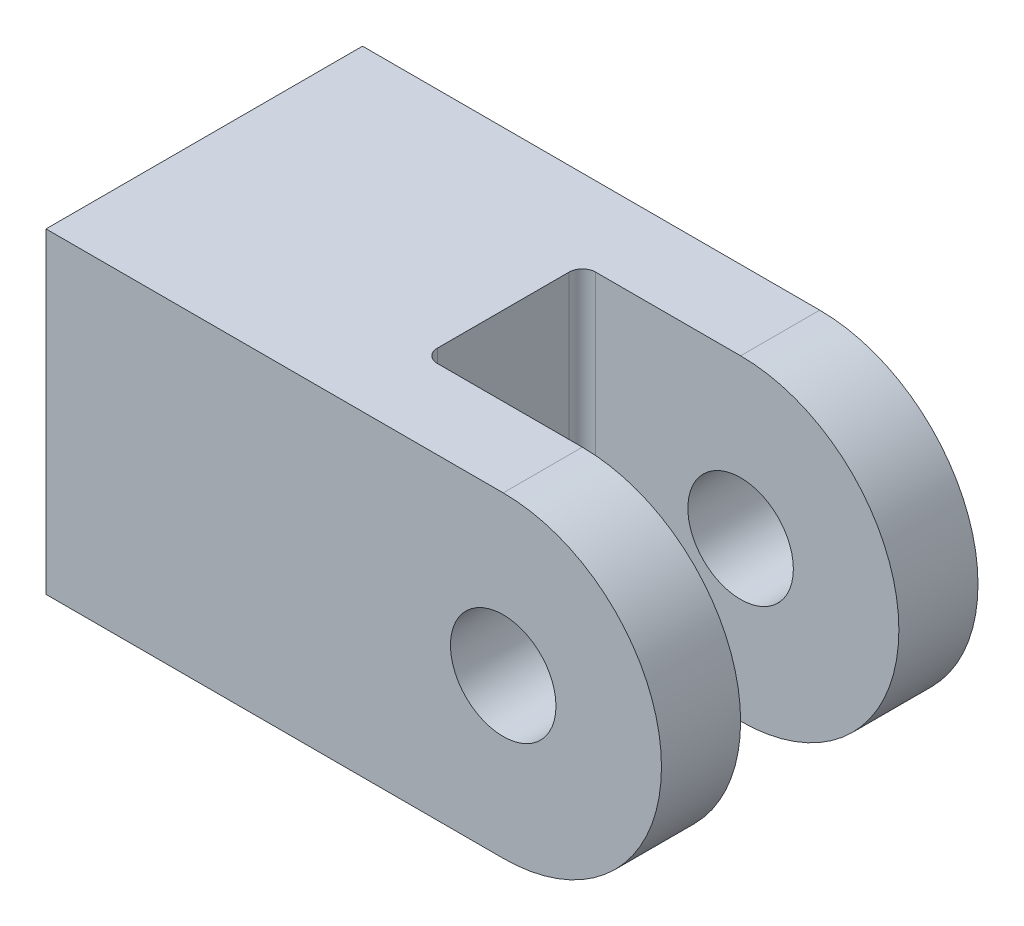
ISO-10303-21;
HEADER;
FILE_DESCRIPTION(('STEP AP214'),'2;1');
FILE_NAME('part.step','',(''),(''),'','','');
FILE_SCHEMA(('AUTOMOTIVE_DESIGN { 1 0 10303 214 1 1 1 1 }'));
ENDSEC;
DATA;
#1=APPLICATION_CONTEXT('core data for automotive mechanical design processes');
#2=APPLICATION_PROTOCOL_DEFINITION('international standard','automotive_design',2000,#1);
#3=PRODUCT_CONTEXT('',#1,'mechanical');
#4=PRODUCT('Part','Part','',(#3));
#5=PRODUCT_RELATED_PRODUCT_CATEGORY('part','',(#4));
#6=PRODUCT_DEFINITION_FORMATION('','',#4);
#7=PRODUCT_DEFINITION_CONTEXT('part definition',#1,'design');
#8=PRODUCT_DEFINITION('design','',#6,#7);
#9=PRODUCT_DEFINITION_SHAPE('','',#8);
#10=(LENGTH_UNIT() NAMED_UNIT(*) SI_UNIT(.MILLI.,.METRE.));
#11=(NAMED_UNIT(*) PLANE_ANGLE_UNIT() SI_UNIT($,.RADIAN.));
#12=(NAMED_UNIT(*) SI_UNIT($,.STERADIAN.) SOLID_ANGLE_UNIT());
#13=UNCERTAINTY_MEASURE_WITH_UNIT(LENGTH_MEASURE(1.E-05),#10,'distance_accuracy_value','');
#14=(GEOMETRIC_REPRESENTATION_CONTEXT(3) GLOBAL_UNCERTAINTY_ASSIGNED_CONTEXT((#13)) GLOBAL_UNIT_ASSIGNED_CONTEXT((#10,
#11,#12)) REPRESENTATION_CONTEXT('',''));
#15=CARTESIAN_POINT('',(0.,0.,0.));
#16=DIRECTION('',(0.,0.,1.));
#17=DIRECTION('',(1.,0.,0.));
#18=AXIS2_PLACEMENT_3D('',#15,#16,#17);
#19=CARTESIAN_POINT('',(52.,18.,18.));
#20=DIRECTION('',(0.,0.,-1.));
#21=DIRECTION('',(-1.,0.,0.));
#22=AXIS2_PLACEMENT_3D('',#19,#20,#21);
#23=CYLINDRICAL_SURFACE('',#22,18.);
#24=CARTESIAN_POINT('',(52.,18.,9.));
#25=DIRECTION('',(0.,0.,-1.));
#26=DIRECTION('',(-1.,0.,0.));
#27=AXIS2_PLACEMENT_3D('',#24,#25,#26);
#28=CIRCLE('',#27,18.);
#29=CARTESIAN_POINT('',(52.,36.,9.));
#30=VERTEX_POINT('',#29);
#31=CARTESIAN_POINT('',(52.,0.,9.));
#32=VERTEX_POINT('',#31);
#33=EDGE_CURVE('E156',#30,#32,#28,.T.);
#34=ORIENTED_EDGE('',*,*,#33,.F.);
#35=DIRECTION('',(0.,0.,-1.));
#36=VECTOR('',#35,1.);
#37=CARTESIAN_POINT('',(52.,36.,18.));
#38=LINE('',#37,#36);
#39=CARTESIAN_POINT('',(52.,36.,18.));
#40=VERTEX_POINT('',#39);
#41=EDGE_CURVE('E148',#40,#30,#38,.T.);
#42=ORIENTED_EDGE('',*,*,#41,.F.);
#43=CARTESIAN_POINT('',(52.,18.,18.));
#44=DIRECTION('',(0.,0.,1.));
#45=DIRECTION('',(1.,0.,0.));
#46=AXIS2_PLACEMENT_3D('',#43,#44,#45);
#47=CIRCLE('',#46,18.);
#48=CARTESIAN_POINT('',(52.,0.,18.));
#49=VERTEX_POINT('',#48);
#50=EDGE_CURVE('E211',#49,#40,#47,.T.);
#51=ORIENTED_EDGE('',*,*,#50,.F.);
#52=DIRECTION('',(0.,0.,-1.));
#53=VECTOR('',#52,1.);
#54=CARTESIAN_POINT('',(52.,0.,18.));
#55=LINE('',#54,#53);
#56=EDGE_CURVE('E136',#49,#32,#55,.T.);
#57=ORIENTED_EDGE('',*,*,#56,.T.);
#58=EDGE_LOOP('',(#34,#42,#51,#57));
#59=FACE_BOUND('',#58,.T.);
#60=ADVANCED_FACE('F34',(#59),#23,.T.);
#61=CARTESIAN_POINT('',(52.,18.,-9.));
#62=DIRECTION('',(0.,0.,1.));
#63=DIRECTION('',(1.,0.,0.));
#64=AXIS2_PLACEMENT_3D('',#61,#62,#63);
#65=CIRCLE('',#64,18.);
#66=CARTESIAN_POINT('',(52.,0.,-9.));
#67=VERTEX_POINT('',#66);
#68=CARTESIAN_POINT('',(52.,36.,-9.));
#69=VERTEX_POINT('',#68);
#70=EDGE_CURVE('E114',#67,#69,#65,.T.);
#71=ORIENTED_EDGE('',*,*,#70,.F.);
#72=CARTESIAN_POINT('',(52.,0.,-18.));
#73=VERTEX_POINT('',#72);
#74=EDGE_CURVE('E126',#67,#73,#55,.T.);
#75=ORIENTED_EDGE('',*,*,#74,.T.);
#76=CARTESIAN_POINT('',(52.,18.,-18.));
#77=DIRECTION('',(0.,0.,1.));
#78=DIRECTION('',(1.,0.,0.));
#79=AXIS2_PLACEMENT_3D('',#76,#77,#78);
#80=CIRCLE('',#79,18.);
#81=CARTESIAN_POINT('',(52.,36.,-18.));
#82=VERTEX_POINT('',#81);
#83=EDGE_CURVE('E222',#73,#82,#80,.T.);
#84=ORIENTED_EDGE('',*,*,#83,.T.);
#85=EDGE_CURVE('E128',#69,#82,#38,.T.);
#86=ORIENTED_EDGE('',*,*,#85,.F.);
#87=EDGE_LOOP('',(#71,#75,#84,#86));
#88=FACE_BOUND('',#87,.T.);
#89=ADVANCED_FACE('F124',(#88),#23,.T.);
#90=CARTESIAN_POINT('',(0.,36.,18.));
#91=DIRECTION('',(0.,1.,0.));
#92=DIRECTION('',(0.,0.,1.));
#93=AXIS2_PLACEMENT_3D('',#90,#91,#92);
#94=PLANE('',#93);
#95=ORIENTED_EDGE('',*,*,#41,.T.);
#96=DIRECTION('',(1.,0.,0.));
#97=VECTOR('',#96,1.);
#98=CARTESIAN_POINT('',(34.,36.,9.));
#99=LINE('',#98,#97);
#100=CARTESIAN_POINT('',(35.5,36.,9.));
#101=VERTEX_POINT('',#100);
#102=EDGE_CURVE('E203',#101,#30,#99,.T.);
#103=ORIENTED_EDGE('',*,*,#102,.F.);
#104=CARTESIAN_POINT('',(35.5,36.,7.5));
#105=DIRECTION('',(0.,1.,0.));
#106=DIRECTION('',(0.,0.,1.));
#107=AXIS2_PLACEMENT_3D('',#104,#105,#106);
#108=CIRCLE('',#107,1.5);
#109=CARTESIAN_POINT('',(34.,36.,7.5));
#110=VERTEX_POINT('',#109);
#111=EDGE_CURVE('E169',#101,#110,#108,.F.);
#112=ORIENTED_EDGE('',*,*,#111,.T.);
#113=DIRECTION('',(0.,0.,1.));
#114=VECTOR('',#113,1.);
#115=CARTESIAN_POINT('',(34.,36.,9.));
#116=LINE('',#115,#114);
#117=CARTESIAN_POINT('',(34.,36.,-7.5));
#118=VERTEX_POINT('',#117);
#119=EDGE_CURVE('E119',#118,#110,#116,.T.);
#120=ORIENTED_EDGE('',*,*,#119,.F.);
#121=CARTESIAN_POINT('',(35.5,36.,-7.5));
#122=DIRECTION('',(0.,1.,0.));
#123=DIRECTION('',(0.,0.,1.));
#124=AXIS2_PLACEMENT_3D('',#121,#122,#123);
#125=CIRCLE('',#124,1.5);
#126=CARTESIAN_POINT('',(35.5,36.,-9.));
#127=VERTEX_POINT('',#126);
#128=EDGE_CURVE('E166',#118,#127,#125,.F.);
#129=ORIENTED_EDGE('',*,*,#128,.T.);
#130=DIRECTION('',(-1.,0.,0.));
#131=VECTOR('',#130,1.);
#132=CARTESIAN_POINT('',(34.,36.,-9.));
#133=LINE('',#132,#131);
#134=EDGE_CURVE('E153',#69,#127,#133,.T.);
#135=ORIENTED_EDGE('',*,*,#134,.F.);
#136=ORIENTED_EDGE('',*,*,#85,.T.);
#137=DIRECTION('',(1.,0.,0.));
#138=VECTOR('',#137,1.);
#139=CARTESIAN_POINT('',(0.,36.,-18.));
#140=LINE('',#139,#138);
#141=CARTESIAN_POINT('',(0.,36.,-18.));
#142=VERTEX_POINT('',#141);
#143=EDGE_CURVE('E219',#142,#82,#140,.T.);
#144=ORIENTED_EDGE('',*,*,#143,.F.);
#145=DIRECTION('',(0.,0.,-1.));
#146=VECTOR('',#145,1.);
#147=CARTESIAN_POINT('',(0.,36.,18.));
#148=LINE('',#147,#146);
#149=CARTESIAN_POINT('',(0.,36.,18.));
#150=VERTEX_POINT('',#149);
#151=EDGE_CURVE('E146',#150,#142,#148,.T.);
#152=ORIENTED_EDGE('',*,*,#151,.F.);
#153=DIRECTION('',(1.,0.,0.));
#154=VECTOR('',#153,1.);
#155=CARTESIAN_POINT('',(0.,36.,18.));
#156=LINE('',#155,#154);
#157=EDGE_CURVE('E206',#150,#40,#156,.T.);
#158=ORIENTED_EDGE('',*,*,#157,.T.);
#159=EDGE_LOOP('',(#95,#103,#112,#120,#129,#135,#136,#144,#152,#158));
#160=FACE_BOUND('',#159,.T.);
#161=ADVANCED_FACE('F193',(#160),#94,.T.);
#162=CARTESIAN_POINT('',(0.,0.,18.));
#163=DIRECTION('',(0.,1.,0.));
#164=DIRECTION('',(0.,0.,1.));
#165=AXIS2_PLACEMENT_3D('',#162,#163,#164);
#166=PLANE('',#165);
#167=DIRECTION('',(0.,0.,1.));
#168=VECTOR('',#167,1.);
#169=CARTESIAN_POINT('',(34.,0.,9.));
#170=LINE('',#169,#168);
#171=CARTESIAN_POINT('',(34.,0.,-7.5));
#172=VERTEX_POINT('',#171);
#173=CARTESIAN_POINT('',(34.,0.,7.5));
#174=VERTEX_POINT('',#173);
#175=EDGE_CURVE('E237',#172,#174,#170,.T.);
#176=ORIENTED_EDGE('',*,*,#175,.T.);
#177=CARTESIAN_POINT('',(35.5,0.,7.5));
#178=DIRECTION('',(0.,1.,0.));
#179=DIRECTION('',(0.,0.,1.));
#180=AXIS2_PLACEMENT_3D('',#177,#178,#179);
#181=CIRCLE('',#180,1.5);
#182=CARTESIAN_POINT('',(35.5,0.,9.));
#183=VERTEX_POINT('',#182);
#184=EDGE_CURVE('E56',#174,#183,#181,.T.);
#185=ORIENTED_EDGE('',*,*,#184,.T.);
#186=DIRECTION('',(1.,0.,0.));
#187=VECTOR('',#186,1.);
#188=CARTESIAN_POINT('',(34.,0.,9.));
#189=LINE('',#188,#187);
#190=EDGE_CURVE('E120',#183,#32,#189,.T.);
#191=ORIENTED_EDGE('',*,*,#190,.T.);
#192=ORIENTED_EDGE('',*,*,#56,.F.);
#193=DIRECTION('',(1.,0.,0.));
#194=VECTOR('',#193,1.);
#195=CARTESIAN_POINT('',(0.,0.,18.));
#196=LINE('',#195,#194);
#197=CARTESIAN_POINT('',(0.,0.,18.));
#198=VERTEX_POINT('',#197);
#199=EDGE_CURVE('E137',#198,#49,#196,.T.);
#200=ORIENTED_EDGE('',*,*,#199,.F.);
#201=DIRECTION('',(0.,0.,-1.));
#202=VECTOR('',#201,1.);
#203=CARTESIAN_POINT('',(0.,0.,18.));
#204=LINE('',#203,#202);
#205=CARTESIAN_POINT('',(0.,0.,-18.));
#206=VERTEX_POINT('',#205);
#207=EDGE_CURVE('E140',#198,#206,#204,.T.);
#208=ORIENTED_EDGE('',*,*,#207,.T.);
#209=DIRECTION('',(1.,0.,0.));
#210=VECTOR('',#209,1.);
#211=CARTESIAN_POINT('',(0.,0.,-18.));
#212=LINE('',#211,#210);
#213=EDGE_CURVE('E134',#206,#73,#212,.T.);
#214=ORIENTED_EDGE('',*,*,#213,.T.);
#215=ORIENTED_EDGE('',*,*,#74,.F.);
#216=DIRECTION('',(-1.,0.,0.));
#217=VECTOR('',#216,1.);
#218=CARTESIAN_POINT('',(34.,0.,-9.));
#219=LINE('',#218,#217);
#220=CARTESIAN_POINT('',(35.5,0.,-9.));
#221=VERTEX_POINT('',#220);
#222=EDGE_CURVE('E110',#67,#221,#219,.T.);
#223=ORIENTED_EDGE('',*,*,#222,.T.);
#224=CARTESIAN_POINT('',(35.5,0.,-7.5));
#225=DIRECTION('',(0.,1.,0.));
#226=DIRECTION('',(0.,0.,1.));
#227=AXIS2_PLACEMENT_3D('',#224,#225,#226);
#228=CIRCLE('',#227,1.5);
#229=EDGE_CURVE('E164',#221,#172,#228,.T.);
#230=ORIENTED_EDGE('',*,*,#229,.T.);
#231=EDGE_LOOP('',(#176,#185,#191,#192,#200,#208,#214,#215,#223,#230));
#232=FACE_BOUND('',#231,.T.);
#233=ADVANCED_FACE('F132',(#232),#166,.F.);
#234=CARTESIAN_POINT('',(52.,18.,-18.));
#235=DIRECTION('',(0.,0.,1.));
#236=DIRECTION('',(1.,0.,0.));
#237=AXIS2_PLACEMENT_3D('',#234,#235,#236);
#238=CYLINDRICAL_SURFACE('',#237,6.);
#239=CARTESIAN_POINT('',(52.,18.,18.));
#240=DIRECTION('',(0.,0.,1.));
#241=DIRECTION('',(1.,0.,0.));
#242=AXIS2_PLACEMENT_3D('',#239,#240,#241);
#243=CIRCLE('',#242,6.);
#244=CARTESIAN_POINT('',(58.,18.,18.));
#245=VERTEX_POINT('',#244);
#246=EDGE_CURVE('E227',#245,#245,#243,.T.);
#247=ORIENTED_EDGE('',*,*,#246,.T.);
#248=EDGE_LOOP('',(#247));
#249=FACE_BOUND('',#248,.T.);
#250=CARTESIAN_POINT('',(52.,18.,9.));
#251=DIRECTION('',(0.,0.,-1.));
#252=DIRECTION('',(-1.,0.,0.));
#253=AXIS2_PLACEMENT_3D('',#250,#251,#252);
#254=CIRCLE('',#253,6.);
#255=CARTESIAN_POINT('',(46.,18.,9.));
#256=VERTEX_POINT('',#255);
#257=EDGE_CURVE('E129',#256,#256,#254,.F.);
#258=ORIENTED_EDGE('',*,*,#257,.F.);
#259=EDGE_LOOP('',(#258));
#260=FACE_BOUND('',#259,.T.);
#261=ADVANCED_FACE('F272',(#249,#260),#238,.F.);
#262=CARTESIAN_POINT('',(52.,18.,-18.));
#263=DIRECTION('',(0.,0.,1.));
#264=DIRECTION('',(1.,0.,0.));
#265=AXIS2_PLACEMENT_3D('',#262,#263,#264);
#266=CIRCLE('',#265,6.);
#267=CARTESIAN_POINT('',(58.,18.,-18.));
#268=VERTEX_POINT('',#267);
#269=EDGE_CURVE('E224',#268,#268,#266,.T.);
#270=ORIENTED_EDGE('',*,*,#269,.F.);
#271=EDGE_LOOP('',(#270));
#272=FACE_BOUND('',#271,.T.);
#273=CARTESIAN_POINT('',(52.,18.,-9.));
#274=DIRECTION('',(0.,0.,1.));
#275=DIRECTION('',(1.,0.,0.));
#276=AXIS2_PLACEMENT_3D('',#273,#274,#275);
#277=CIRCLE('',#276,6.);
#278=CARTESIAN_POINT('',(58.,18.,-9.));
#279=VERTEX_POINT('',#278);
#280=EDGE_CURVE('E130',#279,#279,#277,.F.);
#281=ORIENTED_EDGE('',*,*,#280,.F.);
#282=EDGE_LOOP('',(#281));
#283=FACE_BOUND('',#282,.T.);
#284=ADVANCED_FACE('F275',(#272,#283),#238,.F.);
#285=CARTESIAN_POINT('',(0.,0.,18.));
#286=DIRECTION('',(-1.,0.,0.));
#287=DIRECTION('',(0.,0.,1.));
#288=AXIS2_PLACEMENT_3D('',#285,#286,#287);
#289=PLANE('',#288);
#290=CARTESIAN_POINT('',(0.,18.,0.));
#291=DIRECTION('',(-1.,0.,0.));
#292=DIRECTION('',(0.,0.,1.));
#293=AXIS2_PLACEMENT_3D('',#290,#291,#292);
#294=CIRCLE('',#293,7.99999999999999);
#295=CARTESIAN_POINT('',(0.,18.,7.99999999999999));
#296=VERTEX_POINT('',#295);
#297=EDGE_CURVE('E11',#296,#296,#294,.F.);
#298=ORIENTED_EDGE('',*,*,#297,.T.);
#299=EDGE_LOOP('',(#298));
#300=FACE_BOUND('',#299,.T.);
#301=DIRECTION('',(0.,1.,0.));
#302=VECTOR('',#301,1.);
#303=CARTESIAN_POINT('',(0.,0.,-18.));
#304=LINE('',#303,#302);
#305=EDGE_CURVE('E216',#206,#142,#304,.T.);
#306=ORIENTED_EDGE('',*,*,#305,.F.);
#307=ORIENTED_EDGE('',*,*,#207,.F.);
#308=DIRECTION('',(0.,1.,0.));
#309=VECTOR('',#308,1.);
#310=CARTESIAN_POINT('',(0.,0.,18.));
#311=LINE('',#310,#309);
#312=EDGE_CURVE('E141',#198,#150,#311,.T.);
#313=ORIENTED_EDGE('',*,*,#312,.T.);
#314=ORIENTED_EDGE('',*,*,#151,.T.);
#315=EDGE_LOOP('',(#306,#307,#313,#314));
#316=FACE_BOUND('',#315,.T.);
#317=ADVANCED_FACE('F250',(#300,#316),#289,.T.);
#318=CARTESIAN_POINT('',(52.,18.,18.));
#319=DIRECTION('',(0.,0.,1.));
#320=DIRECTION('',(1.,0.,0.));
#321=AXIS2_PLACEMENT_3D('',#318,#319,#320);
#322=PLANE('',#321);
#323=ORIENTED_EDGE('',*,*,#246,.F.);
#324=EDGE_LOOP('',(#323));
#325=FACE_BOUND('',#324,.T.);
#326=ORIENTED_EDGE('',*,*,#50,.T.);
#327=ORIENTED_EDGE('',*,*,#157,.F.);
#328=ORIENTED_EDGE('',*,*,#312,.F.);
#329=ORIENTED_EDGE('',*,*,#199,.T.);
#330=EDGE_LOOP('',(#326,#327,#328,#329));
#331=FACE_BOUND('',#330,.T.);
#332=ADVANCED_FACE('F252',(#325,#331),#322,.T.);
#333=CARTESIAN_POINT('',(52.,18.,-18.));
#334=DIRECTION('',(0.,0.,1.));
#335=DIRECTION('',(1.,0.,0.));
#336=AXIS2_PLACEMENT_3D('',#333,#334,#335);
#337=PLANE('',#336);
#338=ORIENTED_EDGE('',*,*,#269,.T.);
#339=EDGE_LOOP('',(#338));
#340=FACE_BOUND('',#339,.T.);
#341=ORIENTED_EDGE('',*,*,#83,.F.);
#342=ORIENTED_EDGE('',*,*,#213,.F.);
#343=ORIENTED_EDGE('',*,*,#305,.T.);
#344=ORIENTED_EDGE('',*,*,#143,.T.);
#345=EDGE_LOOP('',(#341,#342,#343,#344));
#346=FACE_BOUND('',#345,.T.);
#347=ADVANCED_FACE('F247',(#340,#346),#337,.F.);
#348=CARTESIAN_POINT('',(25.,18.,0.));
#349=DIRECTION('',(-1.,0.,0.));
#350=DIRECTION('',(0.,0.,1.));
#351=AXIS2_PLACEMENT_3D('',#348,#349,#350);
#352=CYLINDRICAL_SURFACE('',#351,7.5);
#353=CARTESIAN_POINT('',(0.499999999999997,18.,0.));
#354=DIRECTION('',(-1.,0.,0.));
#355=DIRECTION('',(0.,0.,1.));
#356=AXIS2_PLACEMENT_3D('',#353,#354,#355);
#357=CIRCLE('',#356,7.5);
#358=CARTESIAN_POINT('',(0.499999999999997,18.,7.5));
#359=VERTEX_POINT('',#358);
#360=EDGE_CURVE('E41',#359,#359,#357,.T.);
#361=ORIENTED_EDGE('',*,*,#360,.T.);
#362=EDGE_LOOP('',(#361));
#363=FACE_BOUND('',#362,.T.);
#364=CARTESIAN_POINT('',(25.,18.,0.));
#365=DIRECTION('',(-1.,0.,0.));
#366=DIRECTION('',(0.,0.,1.));
#367=AXIS2_PLACEMENT_3D('',#364,#365,#366);
#368=CIRCLE('',#367,7.5);
#369=CARTESIAN_POINT('',(25.,18.,7.5));
#370=VERTEX_POINT('',#369);
#371=EDGE_CURVE('E200',#370,#370,#368,.T.);
#372=ORIENTED_EDGE('',*,*,#371,.F.);
#373=EDGE_LOOP('',(#372));
#374=FACE_BOUND('',#373,.T.);
#375=ADVANCED_FACE('F173',(#363,#374),#352,.F.);
#376=CARTESIAN_POINT('',(25.,18.,0.));
#377=DIRECTION('',(-1.,0.,0.));
#378=DIRECTION('',(0.,0.,1.));
#379=AXIS2_PLACEMENT_3D('',#376,#377,#378);
#380=PLANE('',#379);
#381=ORIENTED_EDGE('',*,*,#371,.T.);
#382=EDGE_LOOP('',(#381));
#383=FACE_BOUND('',#382,.T.);
#384=ADVANCED_FACE('F255',(#383),#380,.T.);
#385=CARTESIAN_POINT('',(34.,36.,9.));
#386=DIRECTION('',(0.,0.,-1.));
#387=DIRECTION('',(-1.,0.,0.));
#388=AXIS2_PLACEMENT_3D('',#385,#386,#387);
#389=PLANE('',#388);
#390=ORIENTED_EDGE('',*,*,#257,.T.);
#391=EDGE_LOOP('',(#390));
#392=FACE_BOUND('',#391,.T.);
#393=ORIENTED_EDGE('',*,*,#190,.F.);
#394=DIRECTION('',(0.,-1.,0.));
#395=VECTOR('',#394,1.);
#396=CARTESIAN_POINT('',(35.5,36.,9.));
#397=LINE('',#396,#395);
#398=EDGE_CURVE('E48',#183,#101,#397,.F.);
#399=ORIENTED_EDGE('',*,*,#398,.T.);
#400=ORIENTED_EDGE('',*,*,#102,.T.);
#401=ORIENTED_EDGE('',*,*,#33,.T.);
#402=EDGE_LOOP('',(#393,#399,#400,#401));
#403=FACE_BOUND('',#402,.T.);
#404=ADVANCED_FACE('F253',(#392,#403),#389,.T.);
#405=CARTESIAN_POINT('',(34.,36.,-9.));
#406=DIRECTION('',(0.,0.,1.));
#407=DIRECTION('',(1.,0.,0.));
#408=AXIS2_PLACEMENT_3D('',#405,#406,#407);
#409=PLANE('',#408);
#410=ORIENTED_EDGE('',*,*,#280,.T.);
#411=EDGE_LOOP('',(#410));
#412=FACE_BOUND('',#411,.T.);
#413=ORIENTED_EDGE('',*,*,#134,.T.);
#414=DIRECTION('',(0.,-1.,0.));
#415=VECTOR('',#414,1.);
#416=CARTESIAN_POINT('',(35.5,0.,-9.));
#417=LINE('',#416,#415);
#418=EDGE_CURVE('E117',#127,#221,#417,.T.);
#419=ORIENTED_EDGE('',*,*,#418,.T.);
#420=ORIENTED_EDGE('',*,*,#222,.F.);
#421=ORIENTED_EDGE('',*,*,#70,.T.);
#422=EDGE_LOOP('',(#413,#419,#420,#421));
#423=FACE_BOUND('',#422,.T.);
#424=ADVANCED_FACE('F113',(#412,#423),#409,.T.);
#425=CARTESIAN_POINT('',(34.,36.,9.));
#426=DIRECTION('',(1.,0.,0.));
#427=DIRECTION('',(0.,0.,-1.));
#428=AXIS2_PLACEMENT_3D('',#425,#426,#427);
#429=PLANE('',#428);
#430=ORIENTED_EDGE('',*,*,#175,.F.);
#431=DIRECTION('',(0.,-1.,0.));
#432=VECTOR('',#431,1.);
#433=CARTESIAN_POINT('',(34.,36.,-7.5));
#434=LINE('',#433,#432);
#435=EDGE_CURVE('E161',#172,#118,#434,.F.);
#436=ORIENTED_EDGE('',*,*,#435,.T.);
#437=ORIENTED_EDGE('',*,*,#119,.T.);
#438=DIRECTION('',(0.,-1.,0.));
#439=VECTOR('',#438,1.);
#440=CARTESIAN_POINT('',(34.,0.,7.5));
#441=LINE('',#440,#439);
#442=EDGE_CURVE('E158',#110,#174,#441,.T.);
#443=ORIENTED_EDGE('',*,*,#442,.T.);
#444=EDGE_LOOP('',(#430,#436,#437,#443));
#445=FACE_BOUND('',#444,.T.);
#446=ADVANCED_FACE('F241',(#445),#429,.T.);
#447=CARTESIAN_POINT('',(35.5,36.,-7.5));
#448=DIRECTION('',(0.,1.,0.));
#449=DIRECTION('',(0.,0.,1.));
#450=AXIS2_PLACEMENT_3D('',#447,#448,#449);
#451=CYLINDRICAL_SURFACE('',#450,1.5);
#452=ORIENTED_EDGE('',*,*,#128,.F.);
#453=ORIENTED_EDGE('',*,*,#435,.F.);
#454=ORIENTED_EDGE('',*,*,#229,.F.);
#455=ORIENTED_EDGE('',*,*,#418,.F.);
#456=EDGE_LOOP('',(#452,#453,#454,#455));
#457=FACE_BOUND('',#456,.T.);
#458=ADVANCED_FACE('F184',(#457),#451,.F.);
#459=CARTESIAN_POINT('',(35.5,36.,7.5));
#460=DIRECTION('',(0.,1.,0.));
#461=DIRECTION('',(0.,0.,1.));
#462=AXIS2_PLACEMENT_3D('',#459,#460,#461);
#463=CYLINDRICAL_SURFACE('',#462,1.5);
#464=ORIENTED_EDGE('',*,*,#111,.F.);
#465=ORIENTED_EDGE('',*,*,#398,.F.);
#466=ORIENTED_EDGE('',*,*,#184,.F.);
#467=ORIENTED_EDGE('',*,*,#442,.F.);
#468=EDGE_LOOP('',(#464,#465,#466,#467));
#469=FACE_BOUND('',#468,.T.);
#470=ADVANCED_FACE('F178',(#469),#463,.F.);
#471=CARTESIAN_POINT('',(0.499999999999997,18.,0.));
#472=DIRECTION('',(-1.,0.,0.));
#473=DIRECTION('',(0.,0.,1.));
#474=AXIS2_PLACEMENT_3D('',#471,#472,#473);
#475=CONICAL_SURFACE('',#474,7.5,0.785398163397445);
#476=ORIENTED_EDGE('',*,*,#297,.F.);
#477=EDGE_LOOP('',(#476));
#478=FACE_BOUND('',#477,.T.);
#479=ORIENTED_EDGE('',*,*,#360,.F.);
#480=EDGE_LOOP('',(#479));
#481=FACE_BOUND('',#480,.T.);
#482=ADVANCED_FACE('F176',(#478,#481),#475,.F.);
#483=CLOSED_SHELL('',(#60,#89,#161,#233,#261,#284,#317,#332,#347,#375,#384,#404,#424,#446,#458,
#470,#482));
#484=MANIFOLD_SOLID_BREP('B2',#483);
#485=ADVANCED_BREP_SHAPE_REPRESENTATION('',(#18,#484),#14);
#486=SHAPE_DEFINITION_REPRESENTATION(#9,#485);
ENDSEC;
END-ISO-10303-21;
